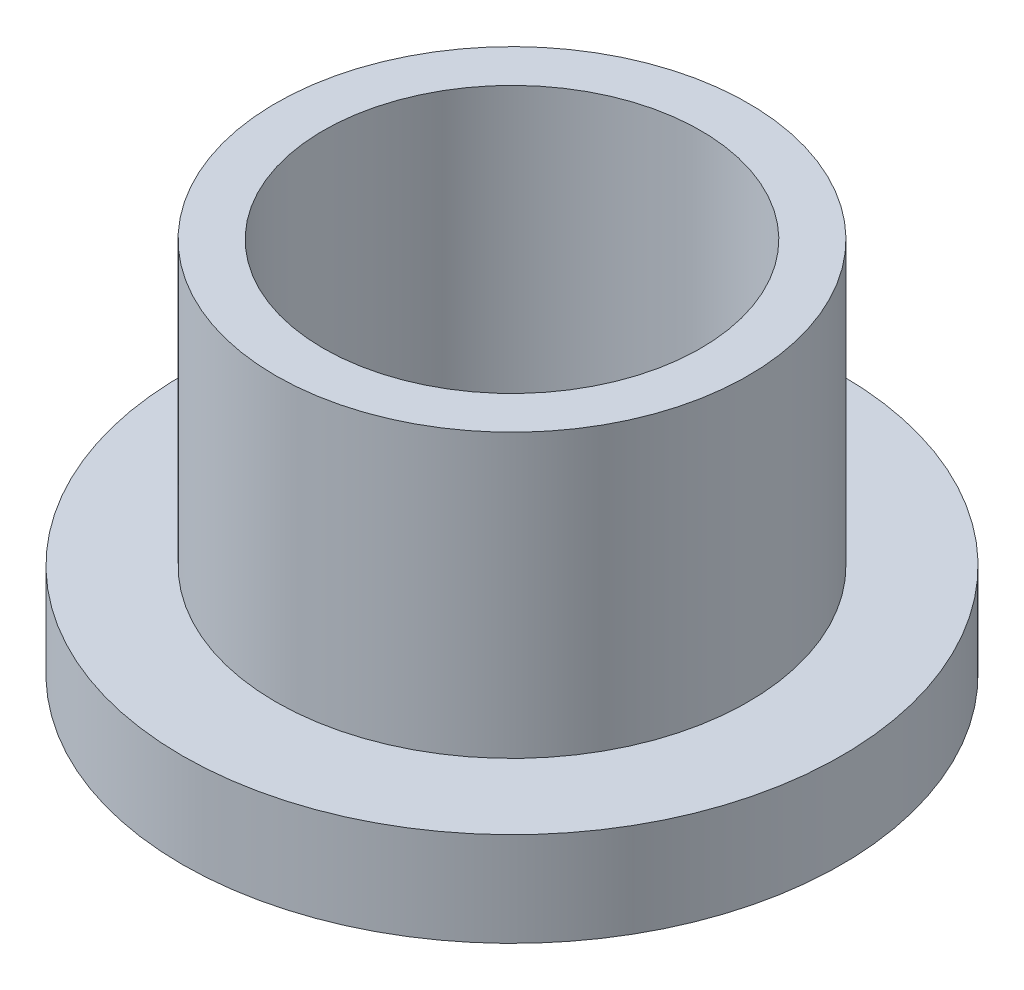
ISO-10303-21;
HEADER;
FILE_DESCRIPTION(('STEP AP214'),'2;1');
FILE_NAME('part.step','',(''),(''),'','','');
FILE_SCHEMA(('AUTOMOTIVE_DESIGN { 1 0 10303 214 1 1 1 1 }'));
ENDSEC;
DATA;
#1=APPLICATION_CONTEXT('core data for automotive mechanical design processes');
#2=APPLICATION_PROTOCOL_DEFINITION('international standard','automotive_design',2000,#1);
#3=PRODUCT_CONTEXT('',#1,'mechanical');
#4=PRODUCT('Part','Part','',(#3));
#5=PRODUCT_RELATED_PRODUCT_CATEGORY('part','',(#4));
#6=PRODUCT_DEFINITION_FORMATION('','',#4);
#7=PRODUCT_DEFINITION_CONTEXT('part definition',#1,'design');
#8=PRODUCT_DEFINITION('design','',#6,#7);
#9=PRODUCT_DEFINITION_SHAPE('','',#8);
#10=(LENGTH_UNIT() NAMED_UNIT(*) SI_UNIT(.MILLI.,.METRE.));
#11=(NAMED_UNIT(*) PLANE_ANGLE_UNIT() SI_UNIT($,.RADIAN.));
#12=(NAMED_UNIT(*) SI_UNIT($,.STERADIAN.) SOLID_ANGLE_UNIT());
#13=UNCERTAINTY_MEASURE_WITH_UNIT(LENGTH_MEASURE(1.E-05),#10,'distance_accuracy_value','');
#14=(GEOMETRIC_REPRESENTATION_CONTEXT(3) GLOBAL_UNCERTAINTY_ASSIGNED_CONTEXT((#13)) GLOBAL_UNIT_ASSIGNED_CONTEXT((#10,
#11,#12)) REPRESENTATION_CONTEXT('',''));
#15=CARTESIAN_POINT('',(0.,0.,0.));
#16=DIRECTION('',(0.,0.,1.));
#17=DIRECTION('',(1.,0.,0.));
#18=AXIS2_PLACEMENT_3D('',#15,#16,#17);
#19=CARTESIAN_POINT('',(0.,12.7,0.));
#20=DIRECTION('',(0.,1.,0.));
#21=DIRECTION('',(0.,0.,1.));
#22=AXIS2_PLACEMENT_3D('',#19,#20,#21);
#23=PLANE('',#22);
#24=CARTESIAN_POINT('',(0.,12.7,0.));
#25=DIRECTION('',(0.,1.,0.));
#26=DIRECTION('',(0.,0.,1.));
#27=AXIS2_PLACEMENT_3D('',#24,#25,#26);
#28=CIRCLE('',#27,7.9629);
#29=CARTESIAN_POINT('',(0.,12.7,7.9629));
#30=VERTEX_POINT('',#29);
#31=EDGE_CURVE('E10',#30,#30,#28,.T.);
#32=ORIENTED_EDGE('',*,*,#31,.T.);
#33=EDGE_LOOP('',(#32));
#34=FACE_BOUND('',#33,.T.);
#35=CARTESIAN_POINT('',(0.,12.7,0.));
#36=DIRECTION('',(0.,1.,0.));
#37=DIRECTION('',(0.,0.,1.));
#38=AXIS2_PLACEMENT_3D('',#35,#36,#37);
#39=CIRCLE('',#38,6.3627);
#40=CARTESIAN_POINT('',(0.,12.7,6.3627));
#41=VERTEX_POINT('',#40);
#42=EDGE_CURVE('E37',#41,#41,#39,.T.);
#43=ORIENTED_EDGE('',*,*,#42,.F.);
#44=EDGE_LOOP('',(#43));
#45=FACE_BOUND('',#44,.T.);
#46=ADVANCED_FACE('F30',(#34,#45),#23,.T.);
#47=CARTESIAN_POINT('',(0.,0.,0.));
#48=DIRECTION('',(0.,1.,0.));
#49=DIRECTION('',(0.,0.,1.));
#50=AXIS2_PLACEMENT_3D('',#47,#48,#49);
#51=PLANE('',#50);
#52=CARTESIAN_POINT('',(0.,0.,0.));
#53=DIRECTION('',(0.,1.,0.));
#54=DIRECTION('',(0.,0.,1.));
#55=AXIS2_PLACEMENT_3D('',#52,#53,#54);
#56=CIRCLE('',#55,6.3627);
#57=CARTESIAN_POINT('',(0.,0.,6.3627));
#58=VERTEX_POINT('',#57);
#59=EDGE_CURVE('E41',#58,#58,#56,.T.);
#60=ORIENTED_EDGE('',*,*,#59,.T.);
#61=EDGE_LOOP('',(#60));
#62=FACE_BOUND('',#61,.T.);
#63=CARTESIAN_POINT('',(0.,0.,0.));
#64=DIRECTION('',(0.,1.,0.));
#65=DIRECTION('',(0.,0.,1.));
#66=AXIS2_PLACEMENT_3D('',#63,#64,#65);
#67=CIRCLE('',#66,11.1125);
#68=CARTESIAN_POINT('',(0.,0.,11.1125));
#69=VERTEX_POINT('',#68);
#70=EDGE_CURVE('E48',#69,#69,#67,.T.);
#71=ORIENTED_EDGE('',*,*,#70,.F.);
#72=EDGE_LOOP('',(#71));
#73=FACE_BOUND('',#72,.T.);
#74=ADVANCED_FACE('F73',(#62,#73),#51,.F.);
#75=CARTESIAN_POINT('',(0.,12.7,0.));
#76=DIRECTION('',(0.,-1.,0.));
#77=DIRECTION('',(0.,0.,-1.));
#78=AXIS2_PLACEMENT_3D('',#75,#76,#77);
#79=CYLINDRICAL_SURFACE('',#78,7.9629);
#80=CARTESIAN_POINT('',(0.,3.175,0.));
#81=DIRECTION('',(0.,1.,0.));
#82=DIRECTION('',(0.,0.,1.));
#83=AXIS2_PLACEMENT_3D('',#80,#81,#82);
#84=CIRCLE('',#83,7.9629);
#85=CARTESIAN_POINT('',(0.,3.175,7.9629));
#86=VERTEX_POINT('',#85);
#87=EDGE_CURVE('E51',#86,#86,#84,.T.);
#88=ORIENTED_EDGE('',*,*,#87,.T.);
#89=EDGE_LOOP('',(#88));
#90=FACE_BOUND('',#89,.T.);
#91=ORIENTED_EDGE('',*,*,#31,.F.);
#92=EDGE_LOOP('',(#91));
#93=FACE_BOUND('',#92,.T.);
#94=ADVANCED_FACE('F32',(#90,#93),#79,.T.);
#95=CARTESIAN_POINT('',(0.,12.7,0.));
#96=DIRECTION('',(0.,-1.,0.));
#97=DIRECTION('',(0.,0.,-1.));
#98=AXIS2_PLACEMENT_3D('',#95,#96,#97);
#99=CYLINDRICAL_SURFACE('',#98,6.3627);
#100=ORIENTED_EDGE('',*,*,#42,.T.);
#101=EDGE_LOOP('',(#100));
#102=FACE_BOUND('',#101,.T.);
#103=ORIENTED_EDGE('',*,*,#59,.F.);
#104=EDGE_LOOP('',(#103));
#105=FACE_BOUND('',#104,.T.);
#106=ADVANCED_FACE('F62',(#102,#105),#99,.F.);
#107=CARTESIAN_POINT('',(0.,3.175,0.));
#108=DIRECTION('',(0.,1.,0.));
#109=DIRECTION('',(0.,0.,1.));
#110=AXIS2_PLACEMENT_3D('',#107,#108,#109);
#111=PLANE('',#110);
#112=CARTESIAN_POINT('',(0.,3.175,0.));
#113=DIRECTION('',(0.,1.,0.));
#114=DIRECTION('',(0.,0.,1.));
#115=AXIS2_PLACEMENT_3D('',#112,#113,#114);
#116=CIRCLE('',#115,11.1125);
#117=CARTESIAN_POINT('',(0.,3.175,11.1125));
#118=VERTEX_POINT('',#117);
#119=EDGE_CURVE('E46',#118,#118,#116,.T.);
#120=ORIENTED_EDGE('',*,*,#119,.T.);
#121=EDGE_LOOP('',(#120));
#122=FACE_BOUND('',#121,.T.);
#123=ORIENTED_EDGE('',*,*,#87,.F.);
#124=EDGE_LOOP('',(#123));
#125=FACE_BOUND('',#124,.T.);
#126=ADVANCED_FACE('F59',(#122,#125),#111,.T.);
#127=CARTESIAN_POINT('',(0.,3.175,0.));
#128=DIRECTION('',(0.,-1.,0.));
#129=DIRECTION('',(0.,0.,-1.));
#130=AXIS2_PLACEMENT_3D('',#127,#128,#129);
#131=CYLINDRICAL_SURFACE('',#130,11.1125);
#132=ORIENTED_EDGE('',*,*,#119,.F.);
#133=EDGE_LOOP('',(#132));
#134=FACE_BOUND('',#133,.T.);
#135=ORIENTED_EDGE('',*,*,#70,.T.);
#136=EDGE_LOOP('',(#135));
#137=FACE_BOUND('',#136,.T.);
#138=ADVANCED_FACE('F61',(#134,#137),#131,.T.);
#139=CLOSED_SHELL('',(#46,#74,#94,#106,#126,#138));
#140=MANIFOLD_SOLID_BREP('B2',#139);
#141=ADVANCED_BREP_SHAPE_REPRESENTATION('',(#18,#140),#14);
#142=SHAPE_DEFINITION_REPRESENTATION(#9,#141);
ENDSEC;
END-ISO-10303-21;
